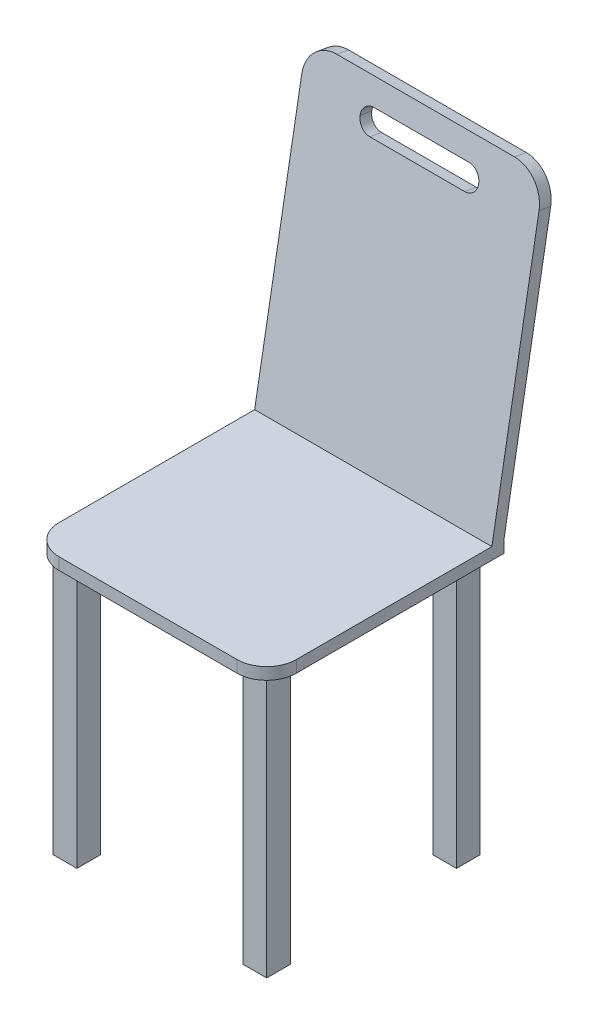
ISO-10303-21;
HEADER;
FILE_DESCRIPTION(('STEP AP214'),'2;1');
FILE_NAME('part.step','',(''),(''),'','','');
FILE_SCHEMA(('AUTOMOTIVE_DESIGN { 1 0 10303 214 1 1 1 1 }'));
ENDSEC;
DATA;
#1=APPLICATION_CONTEXT('core data for automotive mechanical design processes');
#2=APPLICATION_PROTOCOL_DEFINITION('international standard','automotive_design',2000,#1);
#3=PRODUCT_CONTEXT('',#1,'mechanical');
#4=PRODUCT('Part','Part','',(#3));
#5=PRODUCT_RELATED_PRODUCT_CATEGORY('part','',(#4));
#6=PRODUCT_DEFINITION_FORMATION('','',#4);
#7=PRODUCT_DEFINITION_CONTEXT('part definition',#1,'design');
#8=PRODUCT_DEFINITION('design','',#6,#7);
#9=PRODUCT_DEFINITION_SHAPE('','',#8);
#10=(LENGTH_UNIT() NAMED_UNIT(*) SI_UNIT(.MILLI.,.METRE.));
#11=(NAMED_UNIT(*) PLANE_ANGLE_UNIT() SI_UNIT($,.RADIAN.));
#12=(NAMED_UNIT(*) SI_UNIT($,.STERADIAN.) SOLID_ANGLE_UNIT());
#13=UNCERTAINTY_MEASURE_WITH_UNIT(LENGTH_MEASURE(1.E-05),#10,'distance_accuracy_value','');
#14=(GEOMETRIC_REPRESENTATION_CONTEXT(3) GLOBAL_UNCERTAINTY_ASSIGNED_CONTEXT((#13)) GLOBAL_UNIT_ASSIGNED_CONTEXT((#10,
#11,#12)) REPRESENTATION_CONTEXT('',''));
#15=CARTESIAN_POINT('',(0.,0.,0.));
#16=DIRECTION('',(0.,0.,1.));
#17=DIRECTION('',(1.,0.,0.));
#18=AXIS2_PLACEMENT_3D('',#15,#16,#17);
#19=CARTESIAN_POINT('',(0.,0.,0.));
#20=DIRECTION('',(0.,-1.,0.));
#21=DIRECTION('',(0.,0.,-1.));
#22=AXIS2_PLACEMENT_3D('',#19,#20,#21);
#23=PLANE('',#22);
#24=DIRECTION('',(0.,0.,-1.));
#25=VECTOR('',#24,1.);
#26=CARTESIAN_POINT('',(200.,0.,200.));
#27=LINE('',#26,#25);
#28=CARTESIAN_POINT('',(200.,0.,150.));
#29=VERTEX_POINT('',#28);
#30=CARTESIAN_POINT('',(200.,0.,-200.));
#31=VERTEX_POINT('',#30);
#32=EDGE_CURVE('E286',#29,#31,#27,.T.);
#33=ORIENTED_EDGE('',*,*,#32,.F.);
#34=CARTESIAN_POINT('',(150.,0.,150.));
#35=DIRECTION('',(0.,-1.,0.));
#36=DIRECTION('',(0.,0.,-1.));
#37=AXIS2_PLACEMENT_3D('',#34,#35,#36);
#38=CIRCLE('',#37,50.);
#39=CARTESIAN_POINT('',(150.,0.,200.));
#40=VERTEX_POINT('',#39);
#41=EDGE_CURVE('E328',#29,#40,#38,.T.);
#42=ORIENTED_EDGE('',*,*,#41,.T.);
#43=DIRECTION('',(1.,0.,0.));
#44=VECTOR('',#43,1.);
#45=CARTESIAN_POINT('',(-200.,0.,200.));
#46=LINE('',#45,#44);
#47=CARTESIAN_POINT('',(-150.,0.,200.));
#48=VERTEX_POINT('',#47);
#49=EDGE_CURVE('E595',#48,#40,#46,.T.);
#50=ORIENTED_EDGE('',*,*,#49,.F.);
#51=CARTESIAN_POINT('',(-150.,0.,150.));
#52=DIRECTION('',(0.,-1.,0.));
#53=DIRECTION('',(0.,0.,-1.));
#54=AXIS2_PLACEMENT_3D('',#51,#52,#53);
#55=CIRCLE('',#54,50.);
#56=CARTESIAN_POINT('',(-200.,0.,150.));
#57=VERTEX_POINT('',#56);
#58=EDGE_CURVE('E325',#48,#57,#55,.T.);
#59=ORIENTED_EDGE('',*,*,#58,.T.);
#60=DIRECTION('',(0.,0.,1.));
#61=VECTOR('',#60,1.);
#62=CARTESIAN_POINT('',(-200.,0.,200.));
#63=LINE('',#62,#61);
#64=CARTESIAN_POINT('',(-200.,0.,-200.));
#65=VERTEX_POINT('',#64);
#66=EDGE_CURVE('E608',#65,#57,#63,.T.);
#67=ORIENTED_EDGE('',*,*,#66,.F.);
#68=DIRECTION('',(-1.,0.,0.));
#69=VECTOR('',#68,1.);
#70=CARTESIAN_POINT('',(-200.,0.,-200.));
#71=LINE('',#70,#69);
#72=EDGE_CURVE('E605',#31,#65,#71,.T.);
#73=ORIENTED_EDGE('',*,*,#72,.F.);
#74=EDGE_LOOP('',(#33,#42,#50,#59,#67,#73));
#75=FACE_BOUND('',#74,.T.);
#76=DIRECTION('',(1.,0.,0.));
#77=VECTOR('',#76,1.);
#78=CARTESIAN_POINT('',(-180.,0.,140.));
#79=LINE('',#78,#77);
#80=CARTESIAN_POINT('',(-180.,0.,140.));
#81=VERTEX_POINT('',#80);
#82=CARTESIAN_POINT('',(-140.,0.,140.));
#83=VERTEX_POINT('',#82);
#84=EDGE_CURVE('E572',#81,#83,#79,.T.);
#85=ORIENTED_EDGE('',*,*,#84,.F.);
#86=DIRECTION('',(0.,0.,-1.));
#87=VECTOR('',#86,1.);
#88=CARTESIAN_POINT('',(-180.,0.,180.));
#89=LINE('',#88,#87);
#90=CARTESIAN_POINT('',(-180.,0.,180.));
#91=VERTEX_POINT('',#90);
#92=EDGE_CURVE('E553',#91,#81,#89,.T.);
#93=ORIENTED_EDGE('',*,*,#92,.F.);
#94=DIRECTION('',(-1.,0.,0.));
#95=VECTOR('',#94,1.);
#96=CARTESIAN_POINT('',(-180.,0.,180.));
#97=LINE('',#96,#95);
#98=CARTESIAN_POINT('',(-140.,0.,180.));
#99=VERTEX_POINT('',#98);
#100=EDGE_CURVE('E559',#99,#91,#97,.T.);
#101=ORIENTED_EDGE('',*,*,#100,.F.);
#102=DIRECTION('',(0.,0.,1.));
#103=VECTOR('',#102,1.);
#104=CARTESIAN_POINT('',(-140.,0.,180.));
#105=LINE('',#104,#103);
#106=EDGE_CURVE('E575',#83,#99,#105,.T.);
#107=ORIENTED_EDGE('',*,*,#106,.F.);
#108=EDGE_LOOP('',(#85,#93,#101,#107));
#109=FACE_BOUND('',#108,.T.);
#110=DIRECTION('',(0.,0.,-1.));
#111=VECTOR('',#110,1.);
#112=CARTESIAN_POINT('',(140.,0.,180.));
#113=LINE('',#112,#111);
#114=CARTESIAN_POINT('',(140.,0.,180.));
#115=VERTEX_POINT('',#114);
#116=CARTESIAN_POINT('',(140.,0.,140.));
#117=VERTEX_POINT('',#116);
#118=EDGE_CURVE('E531',#115,#117,#113,.T.);
#119=ORIENTED_EDGE('',*,*,#118,.F.);
#120=DIRECTION('',(-1.,0.,0.));
#121=VECTOR('',#120,1.);
#122=CARTESIAN_POINT('',(180.,0.,180.));
#123=LINE('',#122,#121);
#124=CARTESIAN_POINT('',(180.,0.,180.));
#125=VERTEX_POINT('',#124);
#126=EDGE_CURVE('E512',#125,#115,#123,.T.);
#127=ORIENTED_EDGE('',*,*,#126,.F.);
#128=DIRECTION('',(0.,0.,1.));
#129=VECTOR('',#128,1.);
#130=CARTESIAN_POINT('',(180.,0.,180.));
#131=LINE('',#130,#129);
#132=CARTESIAN_POINT('',(180.,0.,140.));
#133=VERTEX_POINT('',#132);
#134=EDGE_CURVE('E518',#133,#125,#131,.T.);
#135=ORIENTED_EDGE('',*,*,#134,.F.);
#136=DIRECTION('',(1.,0.,0.));
#137=VECTOR('',#136,1.);
#138=CARTESIAN_POINT('',(180.,0.,140.));
#139=LINE('',#138,#137);
#140=EDGE_CURVE('E534',#117,#133,#139,.T.);
#141=ORIENTED_EDGE('',*,*,#140,.F.);
#142=EDGE_LOOP('',(#119,#127,#135,#141));
#143=FACE_BOUND('',#142,.T.);
#144=DIRECTION('',(-1.,0.,0.));
#145=VECTOR('',#144,1.);
#146=CARTESIAN_POINT('',(180.,0.,-140.));
#147=LINE('',#146,#145);
#148=CARTESIAN_POINT('',(180.,0.,-140.));
#149=VERTEX_POINT('',#148);
#150=CARTESIAN_POINT('',(140.,0.,-140.));
#151=VERTEX_POINT('',#150);
#152=EDGE_CURVE('E490',#149,#151,#147,.T.);
#153=ORIENTED_EDGE('',*,*,#152,.F.);
#154=DIRECTION('',(0.,0.,1.));
#155=VECTOR('',#154,1.);
#156=CARTESIAN_POINT('',(180.,0.,-180.));
#157=LINE('',#156,#155);
#158=CARTESIAN_POINT('',(180.,0.,-180.));
#159=VERTEX_POINT('',#158);
#160=EDGE_CURVE('E471',#159,#149,#157,.T.);
#161=ORIENTED_EDGE('',*,*,#160,.F.);
#162=DIRECTION('',(1.,0.,0.));
#163=VECTOR('',#162,1.);
#164=CARTESIAN_POINT('',(180.,0.,-180.));
#165=LINE('',#164,#163);
#166=CARTESIAN_POINT('',(140.,0.,-180.));
#167=VERTEX_POINT('',#166);
#168=EDGE_CURVE('E477',#167,#159,#165,.T.);
#169=ORIENTED_EDGE('',*,*,#168,.F.);
#170=DIRECTION('',(0.,0.,-1.));
#171=VECTOR('',#170,1.);
#172=CARTESIAN_POINT('',(140.,0.,-180.));
#173=LINE('',#172,#171);
#174=EDGE_CURVE('E493',#151,#167,#173,.T.);
#175=ORIENTED_EDGE('',*,*,#174,.F.);
#176=EDGE_LOOP('',(#153,#161,#169,#175));
#177=FACE_BOUND('',#176,.T.);
#178=DIRECTION('',(0.,0.,1.));
#179=VECTOR('',#178,1.);
#180=CARTESIAN_POINT('',(-140.,0.,-180.));
#181=LINE('',#180,#179);
#182=CARTESIAN_POINT('',(-140.,0.,-180.));
#183=VERTEX_POINT('',#182);
#184=CARTESIAN_POINT('',(-140.,0.,-140.));
#185=VERTEX_POINT('',#184);
#186=EDGE_CURVE('E449',#183,#185,#181,.T.);
#187=ORIENTED_EDGE('',*,*,#186,.F.);
#188=DIRECTION('',(1.,0.,0.));
#189=VECTOR('',#188,1.);
#190=CARTESIAN_POINT('',(-180.,0.,-180.));
#191=LINE('',#190,#189);
#192=CARTESIAN_POINT('',(-180.,0.,-180.));
#193=VERTEX_POINT('',#192);
#194=EDGE_CURVE('E430',#193,#183,#191,.T.);
#195=ORIENTED_EDGE('',*,*,#194,.F.);
#196=DIRECTION('',(0.,0.,-1.));
#197=VECTOR('',#196,1.);
#198=CARTESIAN_POINT('',(-180.,0.,-180.));
#199=LINE('',#198,#197);
#200=CARTESIAN_POINT('',(-180.,0.,-140.));
#201=VERTEX_POINT('',#200);
#202=EDGE_CURVE('E436',#201,#193,#199,.T.);
#203=ORIENTED_EDGE('',*,*,#202,.F.);
#204=DIRECTION('',(-1.,0.,0.));
#205=VECTOR('',#204,1.);
#206=CARTESIAN_POINT('',(-180.,0.,-140.));
#207=LINE('',#206,#205);
#208=EDGE_CURVE('E452',#185,#201,#207,.T.);
#209=ORIENTED_EDGE('',*,*,#208,.F.);
#210=EDGE_LOOP('',(#187,#195,#203,#209));
#211=FACE_BOUND('',#210,.T.);
#212=ADVANCED_FACE('F39',(#75,#109,#143,#177,#211),#23,.T.);
#213=CARTESIAN_POINT('',(200.,20.,200.));
#214=DIRECTION('',(-1.,0.,0.));
#215=DIRECTION('',(0.,0.,1.));
#216=AXIS2_PLACEMENT_3D('',#213,#214,#215);
#217=PLANE('',#216);
#218=DIRECTION('',(0.,0.984807753012207,-0.173648177666934));
#219=VECTOR('',#218,1.);
#220=CARTESIAN_POINT('',(200.,20.,-200.));
#221=LINE('',#220,#219);
#222=CARTESIAN_POINT('',(200.,20.,-200.));
#223=VERTEX_POINT('',#222);
#224=CARTESIAN_POINT('',(200.,467.286648796051,-278.868704293417));
#225=VERTEX_POINT('',#224);
#226=EDGE_CURVE('E256',#223,#225,#221,.T.);
#227=ORIENTED_EDGE('',*,*,#226,.T.);
#228=DIRECTION('',(0.,0.173648177666935,0.984807753012207));
#229=VECTOR('',#228,1.);
#230=CARTESIAN_POINT('',(200.,535.690677461187,109.069819863763));
#231=LINE('',#230,#229);
#232=CARTESIAN_POINT('',(200.,470.75961234939,-259.172549233173));
#233=VERTEX_POINT('',#232);
#234=EDGE_CURVE('E322',#225,#233,#231,.T.);
#235=ORIENTED_EDGE('',*,*,#234,.T.);
#236=DIRECTION('',(0.,-0.984807753012207,0.173648177666934));
#237=VECTOR('',#236,1.);
#238=CARTESIAN_POINT('',(200.,520.,-267.854958116519));
#239=LINE('',#238,#237);
#240=CARTESIAN_POINT('',(200.,20.,-179.691467762285));
#241=VERTEX_POINT('',#240);
#242=EDGE_CURVE('E270',#233,#241,#239,.T.);
#243=ORIENTED_EDGE('',*,*,#242,.T.);
#244=DIRECTION('',(0.,0.,-1.));
#245=VECTOR('',#244,1.);
#246=CARTESIAN_POINT('',(200.,20.,200.));
#247=LINE('',#246,#245);
#248=CARTESIAN_POINT('',(200.,20.,150.));
#249=VERTEX_POINT('',#248);
#250=EDGE_CURVE('E281',#249,#241,#247,.T.);
#251=ORIENTED_EDGE('',*,*,#250,.F.);
#252=DIRECTION('',(0.,-1.,0.));
#253=VECTOR('',#252,1.);
#254=CARTESIAN_POINT('',(200.,20.,150.));
#255=LINE('',#254,#253);
#256=EDGE_CURVE('E319',#249,#29,#255,.T.);
#257=ORIENTED_EDGE('',*,*,#256,.T.);
#258=ORIENTED_EDGE('',*,*,#32,.T.);
#259=DIRECTION('',(0.,-1.,0.));
#260=VECTOR('',#259,1.);
#261=CARTESIAN_POINT('',(200.,20.,-200.));
#262=LINE('',#261,#260);
#263=EDGE_CURVE('E276',#223,#31,#262,.T.);
#264=ORIENTED_EDGE('',*,*,#263,.F.);
#265=EDGE_LOOP('',(#227,#235,#243,#251,#257,#258,#264));
#266=FACE_BOUND('',#265,.T.);
#267=ADVANCED_FACE('F283',(#266),#217,.F.);
#268=CARTESIAN_POINT('',(-200.,20.,-200.));
#269=DIRECTION('',(0.,0.,1.));
#270=DIRECTION('',(1.,0.,0.));
#271=AXIS2_PLACEMENT_3D('',#268,#269,#270);
#272=PLANE('',#271);
#273=ORIENTED_EDGE('',*,*,#72,.T.);
#274=DIRECTION('',(0.,-1.,0.));
#275=VECTOR('',#274,1.);
#276=CARTESIAN_POINT('',(-200.,20.,-200.));
#277=LINE('',#276,#275);
#278=CARTESIAN_POINT('',(-200.,20.,-200.));
#279=VERTEX_POINT('',#278);
#280=EDGE_CURVE('E278',#279,#65,#277,.T.);
#281=ORIENTED_EDGE('',*,*,#280,.F.);
#282=DIRECTION('',(-1.,0.,0.));
#283=VECTOR('',#282,1.);
#284=CARTESIAN_POINT('',(-200.,20.,-200.));
#285=LINE('',#284,#283);
#286=EDGE_CURVE('E260',#223,#279,#285,.T.);
#287=ORIENTED_EDGE('',*,*,#286,.F.);
#288=ORIENTED_EDGE('',*,*,#263,.T.);
#289=EDGE_LOOP('',(#273,#281,#287,#288));
#290=FACE_BOUND('',#289,.T.);
#291=ADVANCED_FACE('F275',(#290),#272,.F.);
#292=CARTESIAN_POINT('',(-200.,20.,200.));
#293=DIRECTION('',(1.,0.,0.));
#294=DIRECTION('',(0.,0.,-1.));
#295=AXIS2_PLACEMENT_3D('',#292,#293,#294);
#296=PLANE('',#295);
#297=DIRECTION('',(0.,-0.984807753012207,0.173648177666934));
#298=VECTOR('',#297,1.);
#299=CARTESIAN_POINT('',(-200.,520.,-267.854958116519));
#300=LINE('',#299,#298);
#301=CARTESIAN_POINT('',(-200.,470.75961234939,-259.172549233173));
#302=VERTEX_POINT('',#301);
#303=CARTESIAN_POINT('',(-200.,20.,-179.691467762285));
#304=VERTEX_POINT('',#303);
#305=EDGE_CURVE('E271',#302,#304,#300,.T.);
#306=ORIENTED_EDGE('',*,*,#305,.F.);
#307=DIRECTION('',(0.,0.173648177666935,0.984807753012207));
#308=VECTOR('',#307,1.);
#309=CARTESIAN_POINT('',(-200.,535.690677461187,109.069819863763));
#310=LINE('',#309,#308);
#311=CARTESIAN_POINT('',(-200.,467.286648796051,-278.868704293417));
#312=VERTEX_POINT('',#311);
#313=EDGE_CURVE('E311',#302,#312,#310,.F.);
#314=ORIENTED_EDGE('',*,*,#313,.T.);
#315=DIRECTION('',(0.,0.984807753012207,-0.173648177666934));
#316=VECTOR('',#315,1.);
#317=CARTESIAN_POINT('',(-200.,20.,-200.));
#318=LINE('',#317,#316);
#319=EDGE_CURVE('E414',#279,#312,#318,.T.);
#320=ORIENTED_EDGE('',*,*,#319,.F.);
#321=ORIENTED_EDGE('',*,*,#280,.T.);
#322=ORIENTED_EDGE('',*,*,#66,.T.);
#323=DIRECTION('',(0.,-1.,0.));
#324=VECTOR('',#323,1.);
#325=CARTESIAN_POINT('',(-200.,20.,150.));
#326=LINE('',#325,#324);
#327=CARTESIAN_POINT('',(-200.,20.,150.));
#328=VERTEX_POINT('',#327);
#329=EDGE_CURVE('E308',#57,#328,#326,.F.);
#330=ORIENTED_EDGE('',*,*,#329,.T.);
#331=DIRECTION('',(0.,0.,1.));
#332=VECTOR('',#331,1.);
#333=CARTESIAN_POINT('',(-200.,20.,200.));
#334=LINE('',#333,#332);
#335=EDGE_CURVE('E280',#304,#328,#334,.T.);
#336=ORIENTED_EDGE('',*,*,#335,.F.);
#337=EDGE_LOOP('',(#306,#314,#320,#321,#322,#330,#336));
#338=FACE_BOUND('',#337,.T.);
#339=ADVANCED_FACE('F635',(#338),#296,.F.);
#340=CARTESIAN_POINT('',(-200.,20.,200.));
#341=DIRECTION('',(0.,0.,-1.));
#342=DIRECTION('',(-1.,0.,0.));
#343=AXIS2_PLACEMENT_3D('',#340,#341,#342);
#344=PLANE('',#343);
#345=ORIENTED_EDGE('',*,*,#49,.T.);
#346=DIRECTION('',(0.,-1.,0.));
#347=VECTOR('',#346,1.);
#348=CARTESIAN_POINT('',(150.,20.,200.));
#349=LINE('',#348,#347);
#350=CARTESIAN_POINT('',(150.,20.,200.));
#351=VERTEX_POINT('',#350);
#352=EDGE_CURVE('E335',#40,#351,#349,.F.);
#353=ORIENTED_EDGE('',*,*,#352,.T.);
#354=DIRECTION('',(1.,0.,0.));
#355=VECTOR('',#354,1.);
#356=CARTESIAN_POINT('',(-200.,20.,200.));
#357=LINE('',#356,#355);
#358=CARTESIAN_POINT('',(-150.,20.,200.));
#359=VERTEX_POINT('',#358);
#360=EDGE_CURVE('E295',#359,#351,#357,.T.);
#361=ORIENTED_EDGE('',*,*,#360,.F.);
#362=DIRECTION('',(0.,-1.,0.));
#363=VECTOR('',#362,1.);
#364=CARTESIAN_POINT('',(-150.,20.,200.));
#365=LINE('',#364,#363);
#366=EDGE_CURVE('E331',#359,#48,#365,.T.);
#367=ORIENTED_EDGE('',*,*,#366,.T.);
#368=EDGE_LOOP('',(#345,#353,#361,#367));
#369=FACE_BOUND('',#368,.T.);
#370=ADVANCED_FACE('F616',(#369),#344,.F.);
#371=CARTESIAN_POINT('',(0.,20.,0.));
#372=DIRECTION('',(0.,-1.,0.));
#373=DIRECTION('',(0.,0.,-1.));
#374=AXIS2_PLACEMENT_3D('',#371,#372,#373);
#375=PLANE('',#374);
#376=ORIENTED_EDGE('',*,*,#360,.T.);
#377=CARTESIAN_POINT('',(150.,20.,150.));
#378=DIRECTION('',(0.,-1.,0.));
#379=DIRECTION('',(0.,0.,-1.));
#380=AXIS2_PLACEMENT_3D('',#377,#378,#379);
#381=CIRCLE('',#380,50.);
#382=EDGE_CURVE('E341',#351,#249,#381,.F.);
#383=ORIENTED_EDGE('',*,*,#382,.T.);
#384=ORIENTED_EDGE('',*,*,#250,.T.);
#385=DIRECTION('',(-1.,0.,0.));
#386=VECTOR('',#385,1.);
#387=CARTESIAN_POINT('',(200.,20.,-179.691467762285));
#388=LINE('',#387,#386);
#389=EDGE_CURVE('E413',#241,#304,#388,.T.);
#390=ORIENTED_EDGE('',*,*,#389,.T.);
#391=ORIENTED_EDGE('',*,*,#335,.T.);
#392=CARTESIAN_POINT('',(-150.,20.,150.));
#393=DIRECTION('',(0.,-1.,0.));
#394=DIRECTION('',(0.,0.,-1.));
#395=AXIS2_PLACEMENT_3D('',#392,#393,#394);
#396=CIRCLE('',#395,50.);
#397=EDGE_CURVE('E338',#328,#359,#396,.F.);
#398=ORIENTED_EDGE('',*,*,#397,.T.);
#399=EDGE_LOOP('',(#376,#383,#384,#390,#391,#398));
#400=FACE_BOUND('',#399,.T.);
#401=ADVANCED_FACE('F626',(#400),#375,.F.);
#402=CARTESIAN_POINT('',(-180.,-440.,180.));
#403=DIRECTION('',(1.,0.,0.));
#404=DIRECTION('',(0.,0.,-1.));
#405=AXIS2_PLACEMENT_3D('',#402,#403,#404);
#406=PLANE('',#405);
#407=ORIENTED_EDGE('',*,*,#92,.T.);
#408=DIRECTION('',(0.,1.,0.));
#409=VECTOR('',#408,1.);
#410=CARTESIAN_POINT('',(-180.,-440.,140.));
#411=LINE('',#410,#409);
#412=CARTESIAN_POINT('',(-180.,-440.,140.));
#413=VERTEX_POINT('',#412);
#414=EDGE_CURVE('E591',#413,#81,#411,.T.);
#415=ORIENTED_EDGE('',*,*,#414,.F.);
#416=DIRECTION('',(0.,0.,-1.));
#417=VECTOR('',#416,1.);
#418=CARTESIAN_POINT('',(-180.,-440.,180.));
#419=LINE('',#418,#417);
#420=CARTESIAN_POINT('',(-180.,-440.,180.));
#421=VERTEX_POINT('',#420);
#422=EDGE_CURVE('E554',#421,#413,#419,.T.);
#423=ORIENTED_EDGE('',*,*,#422,.F.);
#424=DIRECTION('',(0.,1.,0.));
#425=VECTOR('',#424,1.);
#426=CARTESIAN_POINT('',(-180.,-440.,180.));
#427=LINE('',#426,#425);
#428=EDGE_CURVE('E568',#421,#91,#427,.T.);
#429=ORIENTED_EDGE('',*,*,#428,.T.);
#430=EDGE_LOOP('',(#407,#415,#423,#429));
#431=FACE_BOUND('',#430,.T.);
#432=ADVANCED_FACE('F693',(#431),#406,.F.);
#433=CARTESIAN_POINT('',(-180.,-440.,140.));
#434=DIRECTION('',(0.,0.,1.));
#435=DIRECTION('',(1.,0.,0.));
#436=AXIS2_PLACEMENT_3D('',#433,#434,#435);
#437=PLANE('',#436);
#438=ORIENTED_EDGE('',*,*,#84,.T.);
#439=DIRECTION('',(0.,1.,0.));
#440=VECTOR('',#439,1.);
#441=CARTESIAN_POINT('',(-140.,-440.,140.));
#442=LINE('',#441,#440);
#443=CARTESIAN_POINT('',(-140.,-440.,140.));
#444=VERTEX_POINT('',#443);
#445=EDGE_CURVE('E587',#444,#83,#442,.T.);
#446=ORIENTED_EDGE('',*,*,#445,.F.);
#447=DIRECTION('',(1.,0.,0.));
#448=VECTOR('',#447,1.);
#449=CARTESIAN_POINT('',(-180.,-440.,140.));
#450=LINE('',#449,#448);
#451=EDGE_CURVE('E558',#413,#444,#450,.T.);
#452=ORIENTED_EDGE('',*,*,#451,.F.);
#453=ORIENTED_EDGE('',*,*,#414,.T.);
#454=EDGE_LOOP('',(#438,#446,#452,#453));
#455=FACE_BOUND('',#454,.T.);
#456=ADVANCED_FACE('F700',(#455),#437,.F.);
#457=CARTESIAN_POINT('',(-140.,-440.,180.));
#458=DIRECTION('',(-1.,0.,0.));
#459=DIRECTION('',(0.,0.,1.));
#460=AXIS2_PLACEMENT_3D('',#457,#458,#459);
#461=PLANE('',#460);
#462=ORIENTED_EDGE('',*,*,#106,.T.);
#463=DIRECTION('',(0.,1.,0.));
#464=VECTOR('',#463,1.);
#465=CARTESIAN_POINT('',(-140.,-440.,180.));
#466=LINE('',#465,#464);
#467=CARTESIAN_POINT('',(-140.,-440.,180.));
#468=VERTEX_POINT('',#467);
#469=EDGE_CURVE('E584',#468,#99,#466,.T.);
#470=ORIENTED_EDGE('',*,*,#469,.F.);
#471=DIRECTION('',(0.,0.,1.));
#472=VECTOR('',#471,1.);
#473=CARTESIAN_POINT('',(-140.,-440.,180.));
#474=LINE('',#473,#472);
#475=EDGE_CURVE('E562',#444,#468,#474,.T.);
#476=ORIENTED_EDGE('',*,*,#475,.F.);
#477=ORIENTED_EDGE('',*,*,#445,.T.);
#478=EDGE_LOOP('',(#462,#470,#476,#477));
#479=FACE_BOUND('',#478,.T.);
#480=ADVANCED_FACE('F707',(#479),#461,.F.);
#481=CARTESIAN_POINT('',(-180.,-440.,180.));
#482=DIRECTION('',(0.,0.,-1.));
#483=DIRECTION('',(-1.,0.,0.));
#484=AXIS2_PLACEMENT_3D('',#481,#482,#483);
#485=PLANE('',#484);
#486=ORIENTED_EDGE('',*,*,#100,.T.);
#487=ORIENTED_EDGE('',*,*,#428,.F.);
#488=DIRECTION('',(-1.,0.,0.));
#489=VECTOR('',#488,1.);
#490=CARTESIAN_POINT('',(-180.,-440.,180.));
#491=LINE('',#490,#489);
#492=EDGE_CURVE('E565',#468,#421,#491,.T.);
#493=ORIENTED_EDGE('',*,*,#492,.F.);
#494=ORIENTED_EDGE('',*,*,#469,.T.);
#495=EDGE_LOOP('',(#486,#487,#493,#494));
#496=FACE_BOUND('',#495,.T.);
#497=ADVANCED_FACE('F715',(#496),#485,.F.);
#498=CARTESIAN_POINT('',(0.,-440.,0.));
#499=DIRECTION('',(0.,-1.,0.));
#500=DIRECTION('',(0.,0.,-1.));
#501=AXIS2_PLACEMENT_3D('',#498,#499,#500);
#502=PLANE('',#501);
#503=ORIENTED_EDGE('',*,*,#422,.T.);
#504=ORIENTED_EDGE('',*,*,#451,.T.);
#505=ORIENTED_EDGE('',*,*,#475,.T.);
#506=ORIENTED_EDGE('',*,*,#492,.T.);
#507=EDGE_LOOP('',(#503,#504,#505,#506));
#508=FACE_BOUND('',#507,.T.);
#509=ADVANCED_FACE('F723',(#508),#502,.T.);
#510=CARTESIAN_POINT('',(180.,-440.,180.));
#511=DIRECTION('',(0.,0.,-1.));
#512=DIRECTION('',(-1.,0.,0.));
#513=AXIS2_PLACEMENT_3D('',#510,#511,#512);
#514=PLANE('',#513);
#515=ORIENTED_EDGE('',*,*,#126,.T.);
#516=DIRECTION('',(0.,1.,0.));
#517=VECTOR('',#516,1.);
#518=CARTESIAN_POINT('',(140.,-440.,180.));
#519=LINE('',#518,#517);
#520=CARTESIAN_POINT('',(140.,-440.,180.));
#521=VERTEX_POINT('',#520);
#522=EDGE_CURVE('E550',#521,#115,#519,.T.);
#523=ORIENTED_EDGE('',*,*,#522,.F.);
#524=DIRECTION('',(-1.,0.,0.));
#525=VECTOR('',#524,1.);
#526=CARTESIAN_POINT('',(180.,-440.,180.));
#527=LINE('',#526,#525);
#528=CARTESIAN_POINT('',(180.,-440.,180.));
#529=VERTEX_POINT('',#528);
#530=EDGE_CURVE('E513',#529,#521,#527,.T.);
#531=ORIENTED_EDGE('',*,*,#530,.F.);
#532=DIRECTION('',(0.,1.,0.));
#533=VECTOR('',#532,1.);
#534=CARTESIAN_POINT('',(180.,-440.,180.));
#535=LINE('',#534,#533);
#536=EDGE_CURVE('E527',#529,#125,#535,.T.);
#537=ORIENTED_EDGE('',*,*,#536,.T.);
#538=EDGE_LOOP('',(#515,#523,#531,#537));
#539=FACE_BOUND('',#538,.T.);
#540=ADVANCED_FACE('F731',(#539),#514,.F.);
#541=CARTESIAN_POINT('',(140.,-440.,180.));
#542=DIRECTION('',(1.,0.,0.));
#543=DIRECTION('',(0.,0.,-1.));
#544=AXIS2_PLACEMENT_3D('',#541,#542,#543);
#545=PLANE('',#544);
#546=ORIENTED_EDGE('',*,*,#118,.T.);
#547=DIRECTION('',(0.,1.,0.));
#548=VECTOR('',#547,1.);
#549=CARTESIAN_POINT('',(140.,-440.,140.));
#550=LINE('',#549,#548);
#551=CARTESIAN_POINT('',(140.,-440.,140.));
#552=VERTEX_POINT('',#551);
#553=EDGE_CURVE('E546',#552,#117,#550,.T.);
#554=ORIENTED_EDGE('',*,*,#553,.F.);
#555=DIRECTION('',(0.,0.,-1.));
#556=VECTOR('',#555,1.);
#557=CARTESIAN_POINT('',(140.,-440.,180.));
#558=LINE('',#557,#556);
#559=EDGE_CURVE('E517',#521,#552,#558,.T.);
#560=ORIENTED_EDGE('',*,*,#559,.F.);
#561=ORIENTED_EDGE('',*,*,#522,.T.);
#562=EDGE_LOOP('',(#546,#554,#560,#561));
#563=FACE_BOUND('',#562,.T.);
#564=ADVANCED_FACE('F739',(#563),#545,.F.);
#565=CARTESIAN_POINT('',(180.,-440.,140.));
#566=DIRECTION('',(0.,0.,1.));
#567=DIRECTION('',(1.,0.,0.));
#568=AXIS2_PLACEMENT_3D('',#565,#566,#567);
#569=PLANE('',#568);
#570=ORIENTED_EDGE('',*,*,#140,.T.);
#571=DIRECTION('',(0.,1.,0.));
#572=VECTOR('',#571,1.);
#573=CARTESIAN_POINT('',(180.,-440.,140.));
#574=LINE('',#573,#572);
#575=CARTESIAN_POINT('',(180.,-440.,140.));
#576=VERTEX_POINT('',#575);
#577=EDGE_CURVE('E543',#576,#133,#574,.T.);
#578=ORIENTED_EDGE('',*,*,#577,.F.);
#579=DIRECTION('',(1.,0.,0.));
#580=VECTOR('',#579,1.);
#581=CARTESIAN_POINT('',(180.,-440.,140.));
#582=LINE('',#581,#580);
#583=EDGE_CURVE('E521',#552,#576,#582,.T.);
#584=ORIENTED_EDGE('',*,*,#583,.F.);
#585=ORIENTED_EDGE('',*,*,#553,.T.);
#586=EDGE_LOOP('',(#570,#578,#584,#585));
#587=FACE_BOUND('',#586,.T.);
#588=ADVANCED_FACE('F747',(#587),#569,.F.);
#589=CARTESIAN_POINT('',(180.,-440.,180.));
#590=DIRECTION('',(-1.,0.,0.));
#591=DIRECTION('',(0.,0.,1.));
#592=AXIS2_PLACEMENT_3D('',#589,#590,#591);
#593=PLANE('',#592);
#594=ORIENTED_EDGE('',*,*,#134,.T.);
#595=ORIENTED_EDGE('',*,*,#536,.F.);
#596=DIRECTION('',(0.,0.,1.));
#597=VECTOR('',#596,1.);
#598=CARTESIAN_POINT('',(180.,-440.,180.));
#599=LINE('',#598,#597);
#600=EDGE_CURVE('E524',#576,#529,#599,.T.);
#601=ORIENTED_EDGE('',*,*,#600,.F.);
#602=ORIENTED_EDGE('',*,*,#577,.T.);
#603=EDGE_LOOP('',(#594,#595,#601,#602));
#604=FACE_BOUND('',#603,.T.);
#605=ADVANCED_FACE('F755',(#604),#593,.F.);
#606=CARTESIAN_POINT('',(0.,-440.,0.));
#607=DIRECTION('',(0.,-1.,0.));
#608=DIRECTION('',(0.,0.,-1.));
#609=AXIS2_PLACEMENT_3D('',#606,#607,#608);
#610=PLANE('',#609);
#611=ORIENTED_EDGE('',*,*,#530,.T.);
#612=ORIENTED_EDGE('',*,*,#559,.T.);
#613=ORIENTED_EDGE('',*,*,#583,.T.);
#614=ORIENTED_EDGE('',*,*,#600,.T.);
#615=EDGE_LOOP('',(#611,#612,#613,#614));
#616=FACE_BOUND('',#615,.T.);
#617=ADVANCED_FACE('F763',(#616),#610,.T.);
#618=CARTESIAN_POINT('',(180.,-440.,-180.));
#619=DIRECTION('',(-1.,0.,0.));
#620=DIRECTION('',(0.,0.,1.));
#621=AXIS2_PLACEMENT_3D('',#618,#619,#620);
#622=PLANE('',#621);
#623=ORIENTED_EDGE('',*,*,#160,.T.);
#624=DIRECTION('',(0.,1.,0.));
#625=VECTOR('',#624,1.);
#626=CARTESIAN_POINT('',(180.,-440.,-140.));
#627=LINE('',#626,#625);
#628=CARTESIAN_POINT('',(180.,-440.,-140.));
#629=VERTEX_POINT('',#628);
#630=EDGE_CURVE('E509',#629,#149,#627,.T.);
#631=ORIENTED_EDGE('',*,*,#630,.F.);
#632=DIRECTION('',(0.,0.,1.));
#633=VECTOR('',#632,1.);
#634=CARTESIAN_POINT('',(180.,-440.,-180.));
#635=LINE('',#634,#633);
#636=CARTESIAN_POINT('',(180.,-440.,-180.));
#637=VERTEX_POINT('',#636);
#638=EDGE_CURVE('E472',#637,#629,#635,.T.);
#639=ORIENTED_EDGE('',*,*,#638,.F.);
#640=DIRECTION('',(0.,1.,0.));
#641=VECTOR('',#640,1.);
#642=CARTESIAN_POINT('',(180.,-440.,-180.));
#643=LINE('',#642,#641);
#644=EDGE_CURVE('E486',#637,#159,#643,.T.);
#645=ORIENTED_EDGE('',*,*,#644,.T.);
#646=EDGE_LOOP('',(#623,#631,#639,#645));
#647=FACE_BOUND('',#646,.T.);
#648=ADVANCED_FACE('F771',(#647),#622,.F.);
#649=CARTESIAN_POINT('',(180.,-440.,-140.));
#650=DIRECTION('',(0.,0.,-1.));
#651=DIRECTION('',(-1.,0.,0.));
#652=AXIS2_PLACEMENT_3D('',#649,#650,#651);
#653=PLANE('',#652);
#654=ORIENTED_EDGE('',*,*,#152,.T.);
#655=DIRECTION('',(0.,1.,0.));
#656=VECTOR('',#655,1.);
#657=CARTESIAN_POINT('',(140.,-440.,-140.));
#658=LINE('',#657,#656);
#659=CARTESIAN_POINT('',(140.,-440.,-140.));
#660=VERTEX_POINT('',#659);
#661=EDGE_CURVE('E505',#660,#151,#658,.T.);
#662=ORIENTED_EDGE('',*,*,#661,.F.);
#663=DIRECTION('',(-1.,0.,0.));
#664=VECTOR('',#663,1.);
#665=CARTESIAN_POINT('',(180.,-440.,-140.));
#666=LINE('',#665,#664);
#667=EDGE_CURVE('E476',#629,#660,#666,.T.);
#668=ORIENTED_EDGE('',*,*,#667,.F.);
#669=ORIENTED_EDGE('',*,*,#630,.T.);
#670=EDGE_LOOP('',(#654,#662,#668,#669));
#671=FACE_BOUND('',#670,.T.);
#672=ADVANCED_FACE('F779',(#671),#653,.F.);
#673=CARTESIAN_POINT('',(140.,-440.,-180.));
#674=DIRECTION('',(1.,0.,0.));
#675=DIRECTION('',(0.,0.,-1.));
#676=AXIS2_PLACEMENT_3D('',#673,#674,#675);
#677=PLANE('',#676);
#678=ORIENTED_EDGE('',*,*,#174,.T.);
#679=DIRECTION('',(0.,1.,0.));
#680=VECTOR('',#679,1.);
#681=CARTESIAN_POINT('',(140.,-440.,-180.));
#682=LINE('',#681,#680);
#683=CARTESIAN_POINT('',(140.,-440.,-180.));
#684=VERTEX_POINT('',#683);
#685=EDGE_CURVE('E502',#684,#167,#682,.T.);
#686=ORIENTED_EDGE('',*,*,#685,.F.);
#687=DIRECTION('',(0.,0.,-1.));
#688=VECTOR('',#687,1.);
#689=CARTESIAN_POINT('',(140.,-440.,-180.));
#690=LINE('',#689,#688);
#691=EDGE_CURVE('E480',#660,#684,#690,.T.);
#692=ORIENTED_EDGE('',*,*,#691,.F.);
#693=ORIENTED_EDGE('',*,*,#661,.T.);
#694=EDGE_LOOP('',(#678,#686,#692,#693));
#695=FACE_BOUND('',#694,.T.);
#696=ADVANCED_FACE('F787',(#695),#677,.F.);
#697=CARTESIAN_POINT('',(180.,-440.,-180.));
#698=DIRECTION('',(0.,0.,1.));
#699=DIRECTION('',(1.,0.,0.));
#700=AXIS2_PLACEMENT_3D('',#697,#698,#699);
#701=PLANE('',#700);
#702=ORIENTED_EDGE('',*,*,#168,.T.);
#703=ORIENTED_EDGE('',*,*,#644,.F.);
#704=DIRECTION('',(1.,0.,0.));
#705=VECTOR('',#704,1.);
#706=CARTESIAN_POINT('',(180.,-440.,-180.));
#707=LINE('',#706,#705);
#708=EDGE_CURVE('E483',#684,#637,#707,.T.);
#709=ORIENTED_EDGE('',*,*,#708,.F.);
#710=ORIENTED_EDGE('',*,*,#685,.T.);
#711=EDGE_LOOP('',(#702,#703,#709,#710));
#712=FACE_BOUND('',#711,.T.);
#713=ADVANCED_FACE('F795',(#712),#701,.F.);
#714=CARTESIAN_POINT('',(0.,-440.,0.));
#715=DIRECTION('',(0.,-1.,0.));
#716=DIRECTION('',(0.,0.,-1.));
#717=AXIS2_PLACEMENT_3D('',#714,#715,#716);
#718=PLANE('',#717);
#719=ORIENTED_EDGE('',*,*,#638,.T.);
#720=ORIENTED_EDGE('',*,*,#667,.T.);
#721=ORIENTED_EDGE('',*,*,#691,.T.);
#722=ORIENTED_EDGE('',*,*,#708,.T.);
#723=EDGE_LOOP('',(#719,#720,#721,#722));
#724=FACE_BOUND('',#723,.T.);
#725=ADVANCED_FACE('F803',(#724),#718,.T.);
#726=CARTESIAN_POINT('',(-180.,-440.,-180.));
#727=DIRECTION('',(0.,0.,1.));
#728=DIRECTION('',(1.,0.,0.));
#729=AXIS2_PLACEMENT_3D('',#726,#727,#728);
#730=PLANE('',#729);
#731=ORIENTED_EDGE('',*,*,#194,.T.);
#732=DIRECTION('',(0.,1.,0.));
#733=VECTOR('',#732,1.);
#734=CARTESIAN_POINT('',(-140.,-440.,-180.));
#735=LINE('',#734,#733);
#736=CARTESIAN_POINT('',(-140.,-440.,-180.));
#737=VERTEX_POINT('',#736);
#738=EDGE_CURVE('E468',#737,#183,#735,.T.);
#739=ORIENTED_EDGE('',*,*,#738,.F.);
#740=DIRECTION('',(1.,0.,0.));
#741=VECTOR('',#740,1.);
#742=CARTESIAN_POINT('',(-180.,-440.,-180.));
#743=LINE('',#742,#741);
#744=CARTESIAN_POINT('',(-180.,-440.,-180.));
#745=VERTEX_POINT('',#744);
#746=EDGE_CURVE('E431',#745,#737,#743,.T.);
#747=ORIENTED_EDGE('',*,*,#746,.F.);
#748=DIRECTION('',(0.,1.,0.));
#749=VECTOR('',#748,1.);
#750=CARTESIAN_POINT('',(-180.,-440.,-180.));
#751=LINE('',#750,#749);
#752=EDGE_CURVE('E445',#745,#193,#751,.T.);
#753=ORIENTED_EDGE('',*,*,#752,.T.);
#754=EDGE_LOOP('',(#731,#739,#747,#753));
#755=FACE_BOUND('',#754,.T.);
#756=ADVANCED_FACE('F811',(#755),#730,.F.);
#757=CARTESIAN_POINT('',(-140.,-440.,-180.));
#758=DIRECTION('',(-1.,0.,0.));
#759=DIRECTION('',(0.,0.,1.));
#760=AXIS2_PLACEMENT_3D('',#757,#758,#759);
#761=PLANE('',#760);
#762=ORIENTED_EDGE('',*,*,#186,.T.);
#763=DIRECTION('',(0.,1.,0.));
#764=VECTOR('',#763,1.);
#765=CARTESIAN_POINT('',(-140.,-440.,-140.));
#766=LINE('',#765,#764);
#767=CARTESIAN_POINT('',(-140.,-440.,-140.));
#768=VERTEX_POINT('',#767);
#769=EDGE_CURVE('E464',#768,#185,#766,.T.);
#770=ORIENTED_EDGE('',*,*,#769,.F.);
#771=DIRECTION('',(0.,0.,1.));
#772=VECTOR('',#771,1.);
#773=CARTESIAN_POINT('',(-140.,-440.,-180.));
#774=LINE('',#773,#772);
#775=EDGE_CURVE('E435',#737,#768,#774,.T.);
#776=ORIENTED_EDGE('',*,*,#775,.F.);
#777=ORIENTED_EDGE('',*,*,#738,.T.);
#778=EDGE_LOOP('',(#762,#770,#776,#777));
#779=FACE_BOUND('',#778,.T.);
#780=ADVANCED_FACE('F819',(#779),#761,.F.);
#781=CARTESIAN_POINT('',(-180.,-440.,-140.));
#782=DIRECTION('',(0.,0.,-1.));
#783=DIRECTION('',(-1.,0.,0.));
#784=AXIS2_PLACEMENT_3D('',#781,#782,#783);
#785=PLANE('',#784);
#786=ORIENTED_EDGE('',*,*,#208,.T.);
#787=DIRECTION('',(0.,1.,0.));
#788=VECTOR('',#787,1.);
#789=CARTESIAN_POINT('',(-180.,-440.,-140.));
#790=LINE('',#789,#788);
#791=CARTESIAN_POINT('',(-180.,-440.,-140.));
#792=VERTEX_POINT('',#791);
#793=EDGE_CURVE('E461',#792,#201,#790,.T.);
#794=ORIENTED_EDGE('',*,*,#793,.F.);
#795=DIRECTION('',(-1.,0.,0.));
#796=VECTOR('',#795,1.);
#797=CARTESIAN_POINT('',(-180.,-440.,-140.));
#798=LINE('',#797,#796);
#799=EDGE_CURVE('E439',#768,#792,#798,.T.);
#800=ORIENTED_EDGE('',*,*,#799,.F.);
#801=ORIENTED_EDGE('',*,*,#769,.T.);
#802=EDGE_LOOP('',(#786,#794,#800,#801));
#803=FACE_BOUND('',#802,.T.);
#804=ADVANCED_FACE('F827',(#803),#785,.F.);
#805=CARTESIAN_POINT('',(-180.,-440.,-180.));
#806=DIRECTION('',(1.,0.,0.));
#807=DIRECTION('',(0.,0.,-1.));
#808=AXIS2_PLACEMENT_3D('',#805,#806,#807);
#809=PLANE('',#808);
#810=ORIENTED_EDGE('',*,*,#202,.T.);
#811=ORIENTED_EDGE('',*,*,#752,.F.);
#812=DIRECTION('',(0.,0.,-1.));
#813=VECTOR('',#812,1.);
#814=CARTESIAN_POINT('',(-180.,-440.,-180.));
#815=LINE('',#814,#813);
#816=EDGE_CURVE('E442',#792,#745,#815,.T.);
#817=ORIENTED_EDGE('',*,*,#816,.F.);
#818=ORIENTED_EDGE('',*,*,#793,.T.);
#819=EDGE_LOOP('',(#810,#811,#817,#818));
#820=FACE_BOUND('',#819,.T.);
#821=ADVANCED_FACE('F835',(#820),#809,.F.);
#822=CARTESIAN_POINT('',(0.,-440.,0.));
#823=DIRECTION('',(0.,-1.,0.));
#824=DIRECTION('',(0.,0.,-1.));
#825=AXIS2_PLACEMENT_3D('',#822,#823,#824);
#826=PLANE('',#825);
#827=ORIENTED_EDGE('',*,*,#746,.T.);
#828=ORIENTED_EDGE('',*,*,#775,.T.);
#829=ORIENTED_EDGE('',*,*,#799,.T.);
#830=ORIENTED_EDGE('',*,*,#816,.T.);
#831=EDGE_LOOP('',(#827,#828,#829,#830));
#832=FACE_BOUND('',#831,.T.);
#833=ADVANCED_FACE('F843',(#832),#826,.T.);
#834=CARTESIAN_POINT('',(200.,20.,-200.));
#835=DIRECTION('',(0.,0.173648177666934,0.984807753012207));
#836=DIRECTION('',(0.,-0.984807753012208,0.173648177666934));
#837=AXIS2_PLACEMENT_3D('',#834,#835,#836);
#838=PLANE('',#837);
#839=CARTESIAN_POINT('',(80.,457.438571265929,-277.132222516747));
#840=DIRECTION('',(0.,0.173648177666934,0.984807753012207));
#841=DIRECTION('',(0.,-0.984807753012208,0.173648177666934));
#842=AXIS2_PLACEMENT_3D('',#839,#840,#841);
#843=CIRCLE('',#842,20.);
#844=CARTESIAN_POINT('',(80.,437.742416205685,-273.659258963409));
#845=VERTEX_POINT('',#844);
#846=CARTESIAN_POINT('',(100.,457.438571265929,-277.132222516747));
#847=VERTEX_POINT('',#846);
#848=EDGE_CURVE('E63',#845,#847,#843,.T.);
#849=ORIENTED_EDGE('',*,*,#848,.T.);
#850=CARTESIAN_POINT('',(80.,457.438571265929,-277.132222516747));
#851=DIRECTION('',(0.,0.173648177666934,0.984807753012207));
#852=DIRECTION('',(0.,-0.984807753012208,0.173648177666934));
#853=AXIS2_PLACEMENT_3D('',#850,#851,#852);
#854=CIRCLE('',#853,20.);
#855=CARTESIAN_POINT('',(80.,477.134726326173,-280.605186070086));
#856=VERTEX_POINT('',#855);
#857=EDGE_CURVE('E49',#847,#856,#854,.T.);
#858=ORIENTED_EDGE('',*,*,#857,.T.);
#859=DIRECTION('',(1.,0.,0.));
#860=VECTOR('',#859,1.);
#861=CARTESIAN_POINT('',(100.,477.134726326173,-280.605186070086));
#862=LINE('',#861,#860);
#863=CARTESIAN_POINT('',(-80.,477.134726326173,-280.605186070086));
#864=VERTEX_POINT('',#863);
#865=EDGE_CURVE('E386',#864,#856,#862,.T.);
#866=ORIENTED_EDGE('',*,*,#865,.F.);
#867=CARTESIAN_POINT('',(-80.,457.438571265929,-277.132222516747));
#868=DIRECTION('',(0.,0.173648177666934,0.984807753012207));
#869=DIRECTION('',(0.,-0.984807753012208,0.173648177666934));
#870=AXIS2_PLACEMENT_3D('',#867,#868,#869);
#871=CIRCLE('',#870,20.);
#872=CARTESIAN_POINT('',(-100.,457.438571265929,-277.132222516747));
#873=VERTEX_POINT('',#872);
#874=EDGE_CURVE('E358',#864,#873,#871,.T.);
#875=ORIENTED_EDGE('',*,*,#874,.T.);
#876=CARTESIAN_POINT('',(-80.,457.438571265929,-277.132222516747));
#877=DIRECTION('',(0.,0.173648177666934,0.984807753012207));
#878=DIRECTION('',(0.,-0.984807753012208,0.173648177666934));
#879=AXIS2_PLACEMENT_3D('',#876,#877,#878);
#880=CIRCLE('',#879,20.);
#881=CARTESIAN_POINT('',(-80.,437.742416205685,-273.659258963409));
#882=VERTEX_POINT('',#881);
#883=EDGE_CURVE('E364',#873,#882,#880,.T.);
#884=ORIENTED_EDGE('',*,*,#883,.T.);
#885=DIRECTION('',(-1.,0.,0.));
#886=VECTOR('',#885,1.);
#887=CARTESIAN_POINT('',(100.,437.742416205685,-273.659258963409));
#888=LINE('',#887,#886);
#889=EDGE_CURVE('E379',#845,#882,#888,.T.);
#890=ORIENTED_EDGE('',*,*,#889,.F.);
#891=EDGE_LOOP('',(#849,#858,#866,#875,#884,#890));
#892=FACE_BOUND('',#891,.T.);
#893=ORIENTED_EDGE('',*,*,#319,.T.);
#894=CARTESIAN_POINT('',(-150.,467.286648796051,-278.868704293417));
#895=DIRECTION('',(0.,0.173648177666934,0.984807753012207));
#896=DIRECTION('',(0.,-0.984807753012208,0.173648177666934));
#897=AXIS2_PLACEMENT_3D('',#894,#895,#896);
#898=CIRCLE('',#897,50.);
#899=CARTESIAN_POINT('',(-150.,516.527036446661,-287.551113176763));
#900=VERTEX_POINT('',#899);
#901=EDGE_CURVE('E316',#312,#900,#898,.F.);
#902=ORIENTED_EDGE('',*,*,#901,.T.);
#903=DIRECTION('',(-1.,0.,0.));
#904=VECTOR('',#903,1.);
#905=CARTESIAN_POINT('',(200.,516.527036446661,-287.551113176763));
#906=LINE('',#905,#904);
#907=CARTESIAN_POINT('',(150.,516.527036446661,-287.551113176763));
#908=VERTEX_POINT('',#907);
#909=EDGE_CURVE('E426',#908,#900,#906,.T.);
#910=ORIENTED_EDGE('',*,*,#909,.F.);
#911=CARTESIAN_POINT('',(150.,467.286648796051,-278.868704293417));
#912=DIRECTION('',(0.,0.173648177666934,0.984807753012207));
#913=DIRECTION('',(0.,-0.984807753012208,0.173648177666934));
#914=AXIS2_PLACEMENT_3D('',#911,#912,#913);
#915=CIRCLE('',#914,50.);
#916=EDGE_CURVE('E264',#908,#225,#915,.F.);
#917=ORIENTED_EDGE('',*,*,#916,.T.);
#918=ORIENTED_EDGE('',*,*,#226,.F.);
#919=ORIENTED_EDGE('',*,*,#286,.T.);
#920=EDGE_LOOP('',(#893,#902,#910,#917,#918,#919));
#921=FACE_BOUND('',#920,.T.);
#922=ADVANCED_FACE('F259',(#892,#921),#838,.F.);
#923=CARTESIAN_POINT('',(200.,516.527036446661,-287.551113176763));
#924=DIRECTION('',(0.,-0.984807753012207,0.173648177666935));
#925=DIRECTION('',(0.,-0.173648177666935,-0.984807753012207));
#926=AXIS2_PLACEMENT_3D('',#923,#924,#925);
#927=PLANE('',#926);
#928=ORIENTED_EDGE('',*,*,#909,.T.);
#929=DIRECTION('',(0.,0.173648177666935,0.984807753012207));
#930=VECTOR('',#929,1.);
#931=CARTESIAN_POINT('',(-150.,516.527036446661,-287.551113176763));
#932=LINE('',#931,#930);
#933=CARTESIAN_POINT('',(-150.,520.,-267.854958116519));
#934=VERTEX_POINT('',#933);
#935=EDGE_CURVE('E293',#900,#934,#932,.T.);
#936=ORIENTED_EDGE('',*,*,#935,.T.);
#937=DIRECTION('',(-1.,0.,0.));
#938=VECTOR('',#937,1.);
#939=CARTESIAN_POINT('',(200.,520.,-267.854958116519));
#940=LINE('',#939,#938);
#941=CARTESIAN_POINT('',(150.,520.,-267.854958116519));
#942=VERTEX_POINT('',#941);
#943=EDGE_CURVE('E422',#942,#934,#940,.T.);
#944=ORIENTED_EDGE('',*,*,#943,.F.);
#945=DIRECTION('',(0.,0.173648177666935,0.984807753012207));
#946=VECTOR('',#945,1.);
#947=CARTESIAN_POINT('',(150.,516.527036446661,-287.551113176763));
#948=LINE('',#947,#946);
#949=EDGE_CURVE('E289',#942,#908,#948,.F.);
#950=ORIENTED_EDGE('',*,*,#949,.T.);
#951=EDGE_LOOP('',(#928,#936,#944,#950));
#952=FACE_BOUND('',#951,.T.);
#953=ADVANCED_FACE('F648',(#952),#927,.F.);
#954=CARTESIAN_POINT('',(200.,520.,-267.854958116519));
#955=DIRECTION('',(0.,-0.173648177666934,-0.984807753012207));
#956=DIRECTION('',(0.,0.984807753012207,-0.173648177666934));
#957=AXIS2_PLACEMENT_3D('',#954,#955,#956);
#958=PLANE('',#957);
#959=DIRECTION('',(-1.,0.,0.));
#960=VECTOR('',#959,1.);
#961=CARTESIAN_POINT('',(100.,441.215379759023,-253.963103903165));
#962=LINE('',#961,#960);
#963=CARTESIAN_POINT('',(80.,441.215379759023,-253.963103903165));
#964=VERTEX_POINT('',#963);
#965=CARTESIAN_POINT('',(-80.,441.215379759023,-253.963103903165));
#966=VERTEX_POINT('',#965);
#967=EDGE_CURVE('E402',#964,#966,#962,.T.);
#968=ORIENTED_EDGE('',*,*,#967,.T.);
#969=CARTESIAN_POINT('',(-80.,460.911534819268,-257.436067456503));
#970=DIRECTION('',(0.,-0.173648177666934,-0.984807753012207));
#971=DIRECTION('',(0.,0.984807753012207,-0.173648177666934));
#972=AXIS2_PLACEMENT_3D('',#969,#970,#971);
#973=CIRCLE('',#972,20.);
#974=CARTESIAN_POINT('',(-100.,460.911534819268,-257.436067456504));
#975=VERTEX_POINT('',#974);
#976=EDGE_CURVE('E367',#966,#975,#973,.T.);
#977=ORIENTED_EDGE('',*,*,#976,.T.);
#978=CARTESIAN_POINT('',(-80.,460.911534819268,-257.436067456503));
#979=DIRECTION('',(0.,-0.173648177666934,-0.984807753012207));
#980=DIRECTION('',(0.,0.984807753012207,-0.173648177666934));
#981=AXIS2_PLACEMENT_3D('',#978,#979,#980);
#982=CIRCLE('',#981,20.);
#983=CARTESIAN_POINT('',(-80.,480.607689879512,-260.909031009842));
#984=VERTEX_POINT('',#983);
#985=EDGE_CURVE('E361',#975,#984,#982,.T.);
#986=ORIENTED_EDGE('',*,*,#985,.T.);
#987=DIRECTION('',(1.,0.,0.));
#988=VECTOR('',#987,1.);
#989=CARTESIAN_POINT('',(100.,480.607689879512,-260.909031009842));
#990=LINE('',#989,#988);
#991=CARTESIAN_POINT('',(80.,480.607689879512,-260.909031009842));
#992=VERTEX_POINT('',#991);
#993=EDGE_CURVE('E406',#984,#992,#990,.T.);
#994=ORIENTED_EDGE('',*,*,#993,.T.);
#995=CARTESIAN_POINT('',(80.,460.911534819268,-257.436067456503));
#996=DIRECTION('',(0.,-0.173648177666934,-0.984807753012207));
#997=DIRECTION('',(0.,0.984807753012207,-0.173648177666934));
#998=AXIS2_PLACEMENT_3D('',#995,#996,#997);
#999=CIRCLE('',#998,20.);
#1000=CARTESIAN_POINT('',(100.,460.911534819267,-257.436067456504));
#1001=VERTEX_POINT('',#1000);
#1002=EDGE_CURVE('E11',#992,#1001,#999,.T.);
#1003=ORIENTED_EDGE('',*,*,#1002,.T.);
#1004=CARTESIAN_POINT('',(80.,460.911534819268,-257.436067456503));
#1005=DIRECTION('',(0.,-0.173648177666934,-0.984807753012207));
#1006=DIRECTION('',(0.,0.984807753012207,-0.173648177666934));
#1007=AXIS2_PLACEMENT_3D('',#1004,#1005,#1006);
#1008=CIRCLE('',#1007,20.);
#1009=EDGE_CURVE('E372',#1001,#964,#1008,.T.);
#1010=ORIENTED_EDGE('',*,*,#1009,.T.);
#1011=EDGE_LOOP('',(#968,#977,#986,#994,#1003,#1010));
#1012=FACE_BOUND('',#1011,.T.);
#1013=ORIENTED_EDGE('',*,*,#943,.T.);
#1014=CARTESIAN_POINT('',(-150.,470.75961234939,-259.172549233173));
#1015=DIRECTION('',(0.,-0.173648177666934,-0.984807753012207));
#1016=DIRECTION('',(0.,0.984807753012207,-0.173648177666934));
#1017=AXIS2_PLACEMENT_3D('',#1014,#1015,#1016);
#1018=CIRCLE('',#1017,50.);
#1019=EDGE_CURVE('E305',#934,#302,#1018,.F.);
#1020=ORIENTED_EDGE('',*,*,#1019,.T.);
#1021=ORIENTED_EDGE('',*,*,#305,.T.);
#1022=ORIENTED_EDGE('',*,*,#389,.F.);
#1023=ORIENTED_EDGE('',*,*,#242,.F.);
#1024=CARTESIAN_POINT('',(150.,470.75961234939,-259.172549233173));
#1025=DIRECTION('',(0.,-0.173648177666934,-0.984807753012207));
#1026=DIRECTION('',(0.,0.984807753012207,-0.173648177666934));
#1027=AXIS2_PLACEMENT_3D('',#1024,#1025,#1026);
#1028=CIRCLE('',#1027,50.);
#1029=EDGE_CURVE('E302',#233,#942,#1028,.F.);
#1030=ORIENTED_EDGE('',*,*,#1029,.T.);
#1031=EDGE_LOOP('',(#1013,#1020,#1021,#1022,#1023,#1030));
#1032=FACE_BOUND('',#1031,.T.);
#1033=ADVANCED_FACE('F630',(#1012,#1032),#958,.F.);
#1034=CARTESIAN_POINT('',(-150.,467.286648796051,-278.868704293417));
#1035=DIRECTION('',(0.,0.173648177666935,0.984807753012207));
#1036=DIRECTION('',(0.,-0.984807753012207,0.173648177666935));
#1037=AXIS2_PLACEMENT_3D('',#1034,#1035,#1036);
#1038=CYLINDRICAL_SURFACE('',#1037,50.);
#1039=ORIENTED_EDGE('',*,*,#901,.F.);
#1040=ORIENTED_EDGE('',*,*,#313,.F.);
#1041=ORIENTED_EDGE('',*,*,#1019,.F.);
#1042=ORIENTED_EDGE('',*,*,#935,.F.);
#1043=EDGE_LOOP('',(#1039,#1040,#1041,#1042));
#1044=FACE_BOUND('',#1043,.T.);
#1045=ADVANCED_FACE('F645',(#1044),#1038,.T.);
#1046=CARTESIAN_POINT('',(150.,535.690677461187,109.069819863763));
#1047=DIRECTION('',(0.,0.173648177666935,0.984807753012207));
#1048=DIRECTION('',(0.,-0.984807753012207,0.173648177666935));
#1049=AXIS2_PLACEMENT_3D('',#1046,#1047,#1048);
#1050=CYLINDRICAL_SURFACE('',#1049,50.);
#1051=ORIENTED_EDGE('',*,*,#916,.F.);
#1052=ORIENTED_EDGE('',*,*,#949,.F.);
#1053=ORIENTED_EDGE('',*,*,#1029,.F.);
#1054=ORIENTED_EDGE('',*,*,#234,.F.);
#1055=EDGE_LOOP('',(#1051,#1052,#1053,#1054));
#1056=FACE_BOUND('',#1055,.T.);
#1057=ADVANCED_FACE('F651',(#1056),#1050,.T.);
#1058=CARTESIAN_POINT('',(150.,20.,150.));
#1059=DIRECTION('',(0.,-1.,0.));
#1060=DIRECTION('',(0.,0.,-1.));
#1061=AXIS2_PLACEMENT_3D('',#1058,#1059,#1060);
#1062=CYLINDRICAL_SURFACE('',#1061,50.);
#1063=ORIENTED_EDGE('',*,*,#382,.F.);
#1064=ORIENTED_EDGE('',*,*,#352,.F.);
#1065=ORIENTED_EDGE('',*,*,#41,.F.);
#1066=ORIENTED_EDGE('',*,*,#256,.F.);
#1067=EDGE_LOOP('',(#1063,#1064,#1065,#1066));
#1068=FACE_BOUND('',#1067,.T.);
#1069=ADVANCED_FACE('F622',(#1068),#1062,.T.);
#1070=CARTESIAN_POINT('',(-150.,20.,150.));
#1071=DIRECTION('',(0.,-1.,0.));
#1072=DIRECTION('',(0.,0.,-1.));
#1073=AXIS2_PLACEMENT_3D('',#1070,#1071,#1072);
#1074=CYLINDRICAL_SURFACE('',#1073,50.);
#1075=ORIENTED_EDGE('',*,*,#397,.F.);
#1076=ORIENTED_EDGE('',*,*,#329,.F.);
#1077=ORIENTED_EDGE('',*,*,#58,.F.);
#1078=ORIENTED_EDGE('',*,*,#366,.F.);
#1079=EDGE_LOOP('',(#1075,#1076,#1077,#1078));
#1080=FACE_BOUND('',#1079,.T.);
#1081=ADVANCED_FACE('F640',(#1080),#1074,.T.);
#1082=CARTESIAN_POINT('',(100.,480.607689879512,-260.909031009842));
#1083=DIRECTION('',(0.,0.984807753012207,-0.173648177666934));
#1084=DIRECTION('',(0.,0.173648177666934,0.984807753012208));
#1085=AXIS2_PLACEMENT_3D('',#1082,#1083,#1084);
#1086=PLANE('',#1085);
#1087=ORIENTED_EDGE('',*,*,#993,.F.);
#1088=DIRECTION('',(0.,-0.173648177666934,-0.984807753012208));
#1089=VECTOR('',#1088,1.);
#1090=CARTESIAN_POINT('',(-80.,477.134726326173,-280.605186070086));
#1091=LINE('',#1090,#1089);
#1092=EDGE_CURVE('E347',#984,#864,#1091,.T.);
#1093=ORIENTED_EDGE('',*,*,#1092,.T.);
#1094=ORIENTED_EDGE('',*,*,#865,.T.);
#1095=DIRECTION('',(0.,-0.173648177666934,-0.984807753012208));
#1096=VECTOR('',#1095,1.);
#1097=CARTESIAN_POINT('',(80.,480.607689879512,-260.909031009842));
#1098=LINE('',#1097,#1096);
#1099=EDGE_CURVE('E344',#856,#992,#1098,.F.);
#1100=ORIENTED_EDGE('',*,*,#1099,.T.);
#1101=EDGE_LOOP('',(#1087,#1093,#1094,#1100));
#1102=FACE_BOUND('',#1101,.T.);
#1103=ADVANCED_FACE('F399',(#1102),#1086,.F.);
#1104=CARTESIAN_POINT('',(100.,441.215379759023,-253.963103903165));
#1105=DIRECTION('',(0.,-0.984807753012207,0.173648177666934));
#1106=DIRECTION('',(0.,-0.173648177666934,-0.984807753012208));
#1107=AXIS2_PLACEMENT_3D('',#1104,#1105,#1106);
#1108=PLANE('',#1107);
#1109=ORIENTED_EDGE('',*,*,#889,.T.);
#1110=DIRECTION('',(0.,-0.173648177666934,-0.984807753012208));
#1111=VECTOR('',#1110,1.);
#1112=CARTESIAN_POINT('',(-80.,441.215379759023,-253.963103903165));
#1113=LINE('',#1112,#1111);
#1114=EDGE_CURVE('E355',#882,#966,#1113,.F.);
#1115=ORIENTED_EDGE('',*,*,#1114,.T.);
#1116=ORIENTED_EDGE('',*,*,#967,.F.);
#1117=DIRECTION('',(0.,-0.173648177666934,-0.984807753012208));
#1118=VECTOR('',#1117,1.);
#1119=CARTESIAN_POINT('',(80.,437.742416205685,-273.659258963409));
#1120=LINE('',#1119,#1118);
#1121=EDGE_CURVE('E351',#964,#845,#1120,.T.);
#1122=ORIENTED_EDGE('',*,*,#1121,.T.);
#1123=EDGE_LOOP('',(#1109,#1115,#1116,#1122));
#1124=FACE_BOUND('',#1123,.T.);
#1125=ADVANCED_FACE('F899',(#1124),#1108,.F.);
#1126=CARTESIAN_POINT('',(-80.,460.911534819268,-257.436067456504));
#1127=DIRECTION('',(0.,0.173648177666934,0.984807753012208));
#1128=DIRECTION('',(0.,-0.984807753012207,0.173648177666934));
#1129=AXIS2_PLACEMENT_3D('',#1126,#1127,#1128);
#1130=CYLINDRICAL_SURFACE('',#1129,20.);
#1131=DIRECTION('',(0.,-0.173648177666934,-0.984807753012208));
#1132=VECTOR('',#1131,1.);
#1133=CARTESIAN_POINT('',(-100.,457.438571265929,-277.132222516747));
#1134=LINE('',#1133,#1132);
#1135=EDGE_CURVE('E376',#975,#873,#1134,.T.);
#1136=ORIENTED_EDGE('',*,*,#1135,.F.);
#1137=ORIENTED_EDGE('',*,*,#976,.F.);
#1138=ORIENTED_EDGE('',*,*,#1114,.F.);
#1139=ORIENTED_EDGE('',*,*,#883,.F.);
#1140=EDGE_LOOP('',(#1136,#1137,#1138,#1139));
#1141=FACE_BOUND('',#1140,.T.);
#1142=ADVANCED_FACE('F905',(#1141),#1130,.F.);
#1143=CARTESIAN_POINT('',(-80.,460.911534819268,-257.436067456504));
#1144=DIRECTION('',(0.,0.173648177666934,0.984807753012208));
#1145=DIRECTION('',(0.,-0.984807753012207,0.173648177666934));
#1146=AXIS2_PLACEMENT_3D('',#1143,#1144,#1145);
#1147=CYLINDRICAL_SURFACE('',#1146,20.);
#1148=ORIENTED_EDGE('',*,*,#985,.F.);
#1149=ORIENTED_EDGE('',*,*,#1135,.T.);
#1150=ORIENTED_EDGE('',*,*,#874,.F.);
#1151=ORIENTED_EDGE('',*,*,#1092,.F.);
#1152=EDGE_LOOP('',(#1148,#1149,#1150,#1151));
#1153=FACE_BOUND('',#1152,.T.);
#1154=ADVANCED_FACE('F913',(#1153),#1147,.F.);
#1155=CARTESIAN_POINT('',(80.,460.911534819268,-257.436067456504));
#1156=DIRECTION('',(0.,0.173648177666934,0.984807753012208));
#1157=DIRECTION('',(0.,-0.984807753012208,0.173648177666934));
#1158=AXIS2_PLACEMENT_3D('',#1155,#1156,#1157);
#1159=CYLINDRICAL_SURFACE('',#1158,20.);
#1160=DIRECTION('',(0.,-0.173648177666934,-0.984807753012208));
#1161=VECTOR('',#1160,1.);
#1162=CARTESIAN_POINT('',(100.,457.438571265929,-277.132222516747));
#1163=LINE('',#1162,#1161);
#1164=EDGE_CURVE('E43',#1001,#847,#1163,.T.);
#1165=ORIENTED_EDGE('',*,*,#1164,.F.);
#1166=ORIENTED_EDGE('',*,*,#1002,.F.);
#1167=ORIENTED_EDGE('',*,*,#1099,.F.);
#1168=ORIENTED_EDGE('',*,*,#857,.F.);
#1169=EDGE_LOOP('',(#1165,#1166,#1167,#1168));
#1170=FACE_BOUND('',#1169,.T.);
#1171=ADVANCED_FACE('F41',(#1170),#1159,.F.);
#1172=CARTESIAN_POINT('',(80.,460.911534819267,-257.436067456504));
#1173=DIRECTION('',(0.,0.173648177666934,0.984807753012208));
#1174=DIRECTION('',(0.,-0.984807753012208,0.173648177666934));
#1175=AXIS2_PLACEMENT_3D('',#1172,#1173,#1174);
#1176=CYLINDRICAL_SURFACE('',#1175,20.);
#1177=ORIENTED_EDGE('',*,*,#1009,.F.);
#1178=ORIENTED_EDGE('',*,*,#1164,.T.);
#1179=ORIENTED_EDGE('',*,*,#848,.F.);
#1180=ORIENTED_EDGE('',*,*,#1121,.F.);
#1181=EDGE_LOOP('',(#1177,#1178,#1179,#1180));
#1182=FACE_BOUND('',#1181,.T.);
#1183=ADVANCED_FACE('F391',(#1182),#1176,.F.);
#1184=CLOSED_SHELL('',(#212,#267,#291,#339,#370,#401,#432,#456,#480,#497,#509,#540,#564,#588,
#605,#617,#648,#672,#696,#713,#725,#756,#780,#804,#821,#833,#922,#953,#1033,#1045,#1057,#1069,
#1081,#1103,#1125,#1142,#1154,#1171,#1183));
#1185=MANIFOLD_SOLID_BREP('B2',#1184);
#1186=ADVANCED_BREP_SHAPE_REPRESENTATION('',(#18,#1185),#14);
#1187=SHAPE_DEFINITION_REPRESENTATION(#9,#1186);
ENDSEC;
END-ISO-10303-21;
